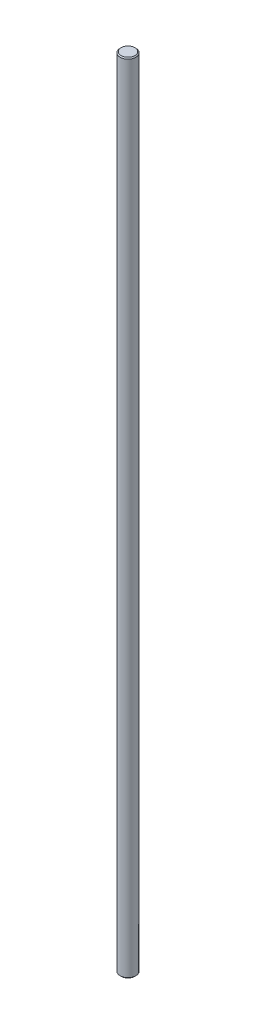
ISO-10303-21;
HEADER;
FILE_DESCRIPTION(('STEP AP214'),'2;1');
FILE_NAME('part.step','',(''),(''),'','','');
FILE_SCHEMA(('AUTOMOTIVE_DESIGN { 1 0 10303 214 1 1 1 1 }'));
ENDSEC;
DATA;
#1=APPLICATION_CONTEXT('core data for automotive mechanical design processes');
#2=APPLICATION_PROTOCOL_DEFINITION('international standard','automotive_design',2000,#1);
#3=PRODUCT_CONTEXT('',#1,'mechanical');
#4=PRODUCT('Part','Part','',(#3));
#5=PRODUCT_RELATED_PRODUCT_CATEGORY('part','',(#4));
#6=PRODUCT_DEFINITION_FORMATION('','',#4);
#7=PRODUCT_DEFINITION_CONTEXT('part definition',#1,'design');
#8=PRODUCT_DEFINITION('design','',#6,#7);
#9=PRODUCT_DEFINITION_SHAPE('','',#8);
#10=(LENGTH_UNIT() NAMED_UNIT(*) SI_UNIT(.MILLI.,.METRE.));
#11=(NAMED_UNIT(*) PLANE_ANGLE_UNIT() SI_UNIT($,.RADIAN.));
#12=(NAMED_UNIT(*) SI_UNIT($,.STERADIAN.) SOLID_ANGLE_UNIT());
#13=UNCERTAINTY_MEASURE_WITH_UNIT(LENGTH_MEASURE(1.E-05),#10,'distance_accuracy_value','');
#14=(GEOMETRIC_REPRESENTATION_CONTEXT(3) GLOBAL_UNCERTAINTY_ASSIGNED_CONTEXT((#13)) GLOBAL_UNIT_ASSIGNED_CONTEXT((#10,
#11,#12)) REPRESENTATION_CONTEXT('',''));
#15=CARTESIAN_POINT('',(0.,0.,0.));
#16=DIRECTION('',(0.,0.,1.));
#17=DIRECTION('',(1.,0.,0.));
#18=AXIS2_PLACEMENT_3D('',#15,#16,#17);
#19=CARTESIAN_POINT('',(0.,406.4,0.));
#20=DIRECTION('',(0.,-1.,0.));
#21=DIRECTION('',(0.,0.,-1.));
#22=AXIS2_PLACEMENT_3D('',#19,#20,#21);
#23=CYLINDRICAL_SURFACE('',#22,4.);
#24=CARTESIAN_POINT('',(0.,0.5,0.));
#25=DIRECTION('',(0.,1.,0.));
#26=DIRECTION('',(0.,0.,1.));
#27=AXIS2_PLACEMENT_3D('',#24,#25,#26);
#28=CIRCLE('',#27,4.);
#29=CARTESIAN_POINT('',(0.,0.5,4.));
#30=VERTEX_POINT('',#29);
#31=EDGE_CURVE('E42',#30,#30,#28,.T.);
#32=ORIENTED_EDGE('',*,*,#31,.T.);
#33=EDGE_LOOP('',(#32));
#34=FACE_BOUND('',#33,.T.);
#35=CARTESIAN_POINT('',(0.,405.9,0.));
#36=DIRECTION('',(0.,1.,0.));
#37=DIRECTION('',(0.,0.,1.));
#38=AXIS2_PLACEMENT_3D('',#35,#36,#37);
#39=CIRCLE('',#38,4.);
#40=CARTESIAN_POINT('',(0.,405.9,4.));
#41=VERTEX_POINT('',#40);
#42=EDGE_CURVE('E46',#41,#41,#39,.F.);
#43=ORIENTED_EDGE('',*,*,#42,.T.);
#44=EDGE_LOOP('',(#43));
#45=FACE_BOUND('',#44,.T.);
#46=ADVANCED_FACE('F31',(#34,#45),#23,.T.);
#47=CARTESIAN_POINT('',(0.,406.4,0.));
#48=DIRECTION('',(0.,1.,0.));
#49=DIRECTION('',(0.,0.,1.));
#50=AXIS2_PLACEMENT_3D('',#47,#48,#49);
#51=PLANE('',#50);
#52=CARTESIAN_POINT('',(0.,406.4,0.));
#53=DIRECTION('',(0.,1.,0.));
#54=DIRECTION('',(0.,0.,1.));
#55=AXIS2_PLACEMENT_3D('',#52,#53,#54);
#56=CIRCLE('',#55,3.50000000000006);
#57=CARTESIAN_POINT('',(0.,406.4,3.50000000000006));
#58=VERTEX_POINT('',#57);
#59=EDGE_CURVE('E10',#58,#58,#56,.T.);
#60=ORIENTED_EDGE('',*,*,#59,.T.);
#61=EDGE_LOOP('',(#60));
#62=FACE_BOUND('',#61,.T.);
#63=ADVANCED_FACE('F62',(#62),#51,.T.);
#64=CARTESIAN_POINT('',(0.,0.,0.));
#65=DIRECTION('',(0.,1.,0.));
#66=DIRECTION('',(0.,0.,1.));
#67=AXIS2_PLACEMENT_3D('',#64,#65,#66);
#68=PLANE('',#67);
#69=CARTESIAN_POINT('',(0.,0.,0.));
#70=DIRECTION('',(0.,1.,0.));
#71=DIRECTION('',(0.,0.,1.));
#72=AXIS2_PLACEMENT_3D('',#69,#70,#71);
#73=CIRCLE('',#72,3.5);
#74=CARTESIAN_POINT('',(0.,0.,3.5));
#75=VERTEX_POINT('',#74);
#76=EDGE_CURVE('E38',#75,#75,#73,.F.);
#77=ORIENTED_EDGE('',*,*,#76,.T.);
#78=EDGE_LOOP('',(#77));
#79=FACE_BOUND('',#78,.T.);
#80=ADVANCED_FACE('F59',(#79),#68,.F.);
#81=CARTESIAN_POINT('',(0.,0.5,0.));
#82=DIRECTION('',(0.,1.,0.));
#83=DIRECTION('',(0.,0.,1.));
#84=AXIS2_PLACEMENT_3D('',#81,#82,#83);
#85=CONICAL_SURFACE('',#84,4.,0.785398163397445);
#86=ORIENTED_EDGE('',*,*,#76,.F.);
#87=EDGE_LOOP('',(#86));
#88=FACE_BOUND('',#87,.T.);
#89=ORIENTED_EDGE('',*,*,#31,.F.);
#90=EDGE_LOOP('',(#89));
#91=FACE_BOUND('',#90,.T.);
#92=ADVANCED_FACE('F55',(#88,#91),#85,.T.);
#93=CARTESIAN_POINT('',(0.,406.4,0.));
#94=DIRECTION('',(0.,-1.,0.));
#95=DIRECTION('',(0.,0.,-1.));
#96=AXIS2_PLACEMENT_3D('',#93,#94,#95);
#97=CONICAL_SURFACE('',#96,3.50000000000006,0.785398163397445);
#98=ORIENTED_EDGE('',*,*,#42,.F.);
#99=EDGE_LOOP('',(#98));
#100=FACE_BOUND('',#99,.T.);
#101=ORIENTED_EDGE('',*,*,#59,.F.);
#102=EDGE_LOOP('',(#101));
#103=FACE_BOUND('',#102,.T.);
#104=ADVANCED_FACE('F33',(#100,#103),#97,.T.);
#105=CLOSED_SHELL('',(#46,#63,#80,#92,#104));
#106=MANIFOLD_SOLID_BREP('B2',#105);
#107=ADVANCED_BREP_SHAPE_REPRESENTATION('',(#18,#106),#14);
#108=SHAPE_DEFINITION_REPRESENTATION(#9,#107);
ENDSEC;
END-ISO-10303-21;
